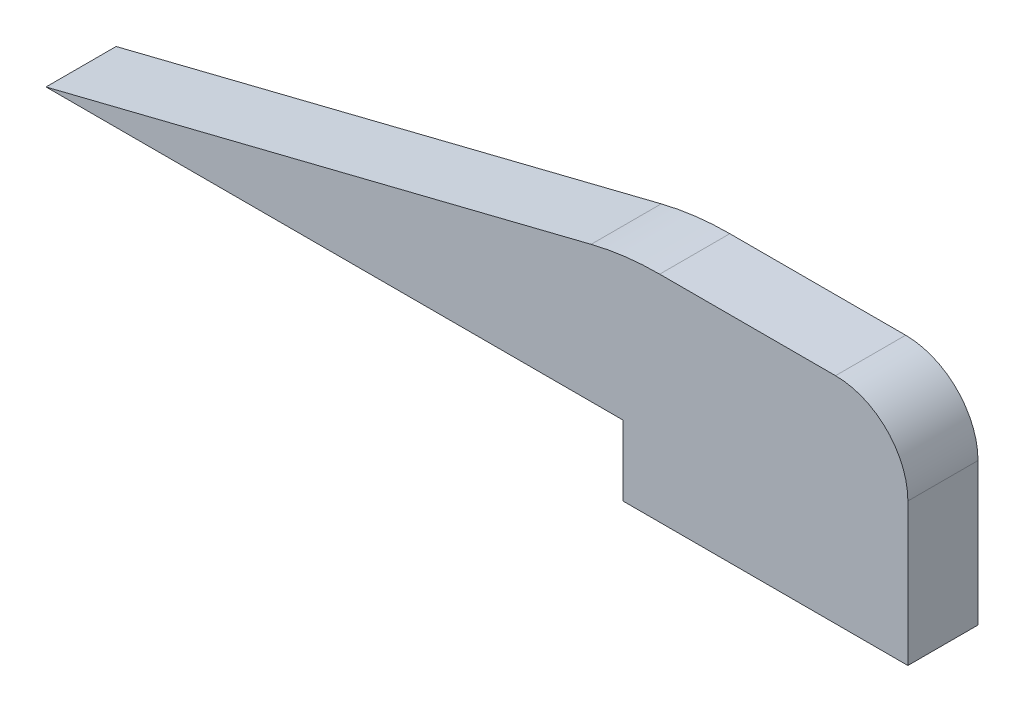
ISO-10303-21;
HEADER;
FILE_DESCRIPTION(('STEP AP214'),'2;1');
FILE_NAME('part.step','',(''),(''),'','','');
FILE_SCHEMA(('AUTOMOTIVE_DESIGN { 1 0 10303 214 1 1 1 1 }'));
ENDSEC;
DATA;
#1=APPLICATION_CONTEXT('core data for automotive mechanical design processes');
#2=APPLICATION_PROTOCOL_DEFINITION('international standard','automotive_design',2000,#1);
#3=PRODUCT_CONTEXT('',#1,'mechanical');
#4=PRODUCT('Part','Part','',(#3));
#5=PRODUCT_RELATED_PRODUCT_CATEGORY('part','',(#4));
#6=PRODUCT_DEFINITION_FORMATION('','',#4);
#7=PRODUCT_DEFINITION_CONTEXT('part definition',#1,'design');
#8=PRODUCT_DEFINITION('design','',#6,#7);
#9=PRODUCT_DEFINITION_SHAPE('','',#8);
#10=(LENGTH_UNIT() NAMED_UNIT(*) SI_UNIT(.MILLI.,.METRE.));
#11=(NAMED_UNIT(*) PLANE_ANGLE_UNIT() SI_UNIT($,.RADIAN.));
#12=(NAMED_UNIT(*) SI_UNIT($,.STERADIAN.) SOLID_ANGLE_UNIT());
#13=UNCERTAINTY_MEASURE_WITH_UNIT(LENGTH_MEASURE(1.E-05),#10,'distance_accuracy_value','');
#14=(GEOMETRIC_REPRESENTATION_CONTEXT(3) GLOBAL_UNCERTAINTY_ASSIGNED_CONTEXT((#13)) GLOBAL_UNIT_ASSIGNED_CONTEXT((#10,
#11,#12)) REPRESENTATION_CONTEXT('',''));
#15=CARTESIAN_POINT('',(0.,0.,0.));
#16=DIRECTION('',(0.,0.,1.));
#17=DIRECTION('',(1.,0.,0.));
#18=AXIS2_PLACEMENT_3D('',#15,#16,#17);
#19=CARTESIAN_POINT('',(34.925,3.175,3.175));
#20=DIRECTION('',(0.,0.,-1.));
#21=DIRECTION('',(-1.,0.,0.));
#22=AXIS2_PLACEMENT_3D('',#19,#20,#21);
#23=CYLINDRICAL_SURFACE('',#22,3.2766);
#24=CARTESIAN_POINT('',(34.925,3.175,0.));
#25=DIRECTION('',(0.,0.,1.));
#26=DIRECTION('',(-1.,0.,0.));
#27=AXIS2_PLACEMENT_3D('',#24,#25,#26);
#28=CIRCLE('',#27,3.2766);
#29=CARTESIAN_POINT('',(38.2016,3.175,0.));
#30=VERTEX_POINT('',#29);
#31=CARTESIAN_POINT('',(34.925,6.4516,0.));
#32=VERTEX_POINT('',#31);
#33=EDGE_CURVE('E191',#30,#32,#28,.T.);
#34=ORIENTED_EDGE('',*,*,#33,.T.);
#35=DIRECTION('',(0.,0.,-1.));
#36=VECTOR('',#35,1.);
#37=CARTESIAN_POINT('',(34.925,6.4516,3.175));
#38=LINE('',#37,#36);
#39=CARTESIAN_POINT('',(34.925,6.4516,3.175));
#40=VERTEX_POINT('',#39);
#41=EDGE_CURVE('E12',#40,#32,#38,.T.);
#42=ORIENTED_EDGE('',*,*,#41,.F.);
#43=CARTESIAN_POINT('',(34.925,3.175,3.175));
#44=DIRECTION('',(0.,0.,1.));
#45=DIRECTION('',(-1.,0.,0.));
#46=AXIS2_PLACEMENT_3D('',#43,#44,#45);
#47=CIRCLE('',#46,3.2766);
#48=CARTESIAN_POINT('',(38.2016,3.175,3.175));
#49=VERTEX_POINT('',#48);
#50=EDGE_CURVE('E156',#49,#40,#47,.T.);
#51=ORIENTED_EDGE('',*,*,#50,.F.);
#52=DIRECTION('',(0.,0.,-1.));
#53=VECTOR('',#52,1.);
#54=CARTESIAN_POINT('',(38.2016,3.175,3.175));
#55=LINE('',#54,#53);
#56=EDGE_CURVE('E131',#49,#30,#55,.T.);
#57=ORIENTED_EDGE('',*,*,#56,.T.);
#58=EDGE_LOOP('',(#34,#42,#51,#57));
#59=FACE_BOUND('',#58,.T.);
#60=ADVANCED_FACE('F36',(#59),#23,.T.);
#61=CARTESIAN_POINT('',(26.9634414453443,6.4516,3.175));
#62=DIRECTION('',(0.,-1.,0.));
#63=DIRECTION('',(0.,0.,-1.));
#64=AXIS2_PLACEMENT_3D('',#61,#62,#63);
#65=PLANE('',#64);
#66=DIRECTION('',(-1.,0.,0.));
#67=VECTOR('',#66,1.);
#68=CARTESIAN_POINT('',(26.9634414453443,6.4516,0.));
#69=LINE('',#68,#67);
#70=CARTESIAN_POINT('',(26.9634414453443,6.4516,0.));
#71=VERTEX_POINT('',#70);
#72=EDGE_CURVE('E185',#32,#71,#69,.T.);
#73=ORIENTED_EDGE('',*,*,#72,.T.);
#74=DIRECTION('',(0.,0.,-1.));
#75=VECTOR('',#74,1.);
#76=CARTESIAN_POINT('',(26.9634414453443,6.4516,3.175));
#77=LINE('',#76,#75);
#78=CARTESIAN_POINT('',(26.9634414453443,6.4516,3.175));
#79=VERTEX_POINT('',#78);
#80=EDGE_CURVE('E44',#79,#71,#77,.T.);
#81=ORIENTED_EDGE('',*,*,#80,.F.);
#82=DIRECTION('',(-1.,0.,0.));
#83=VECTOR('',#82,1.);
#84=CARTESIAN_POINT('',(26.9634414453443,6.4516,3.175));
#85=LINE('',#84,#83);
#86=EDGE_CURVE('E95',#40,#79,#85,.T.);
#87=ORIENTED_EDGE('',*,*,#86,.F.);
#88=ORIENTED_EDGE('',*,*,#41,.T.);
#89=EDGE_LOOP('',(#73,#81,#87,#88));
#90=FACE_BOUND('',#89,.T.);
#91=ADVANCED_FACE('F210',(#90),#65,.F.);
#92=CARTESIAN_POINT('',(26.9634414453443,-6.35,3.175));
#93=DIRECTION('',(0.,0.,-1.));
#94=DIRECTION('',(-1.,0.,0.));
#95=AXIS2_PLACEMENT_3D('',#92,#93,#94);
#96=CYLINDRICAL_SURFACE('',#95,12.8016);
#97=CARTESIAN_POINT('',(26.9634414453443,-6.35,0.));
#98=DIRECTION('',(0.,0.,1.));
#99=DIRECTION('',(-1.,0.,0.));
#100=AXIS2_PLACEMENT_3D('',#97,#98,#99);
#101=CIRCLE('',#100,12.8016);
#102=CARTESIAN_POINT('',(23.8585973878792,6.06937622986048,0.));
#103=VERTEX_POINT('',#102);
#104=EDGE_CURVE('E180',#71,#103,#101,.T.);
#105=ORIENTED_EDGE('',*,*,#104,.T.);
#106=DIRECTION('',(0.,0.,-1.));
#107=VECTOR('',#106,1.);
#108=CARTESIAN_POINT('',(23.8585973878792,6.06937622986048,3.175));
#109=LINE('',#108,#107);
#110=CARTESIAN_POINT('',(23.8585973878792,6.06937622986048,3.175));
#111=VERTEX_POINT('',#110);
#112=EDGE_CURVE('E172',#111,#103,#109,.T.);
#113=ORIENTED_EDGE('',*,*,#112,.F.);
#114=CARTESIAN_POINT('',(26.9634414453443,-6.35,3.175));
#115=DIRECTION('',(0.,0.,1.));
#116=DIRECTION('',(-1.,0.,0.));
#117=AXIS2_PLACEMENT_3D('',#114,#115,#116);
#118=CIRCLE('',#117,12.8016);
#119=EDGE_CURVE('E148',#79,#111,#118,.T.);
#120=ORIENTED_EDGE('',*,*,#119,.F.);
#121=ORIENTED_EDGE('',*,*,#80,.T.);
#122=EDGE_LOOP('',(#105,#113,#120,#121));
#123=FACE_BOUND('',#122,.T.);
#124=ADVANCED_FACE('F178',(#123),#96,.T.);
#125=CARTESIAN_POINT('',(-0.825307531562761,-0.101600000000002,3.175));
#126=DIRECTION('',(0.242535625036333,-0.970142500145332,0.));
#127=DIRECTION('',(0.970142500145332,0.242535625036333,0.));
#128=AXIS2_PLACEMENT_3D('',#125,#126,#127);
#129=PLANE('',#128);
#130=DIRECTION('',(-0.970142500145332,-0.242535625036333,0.));
#131=VECTOR('',#130,1.);
#132=CARTESIAN_POINT('',(-0.825307531562761,-0.101600000000002,0.));
#133=LINE('',#132,#131);
#134=CARTESIAN_POINT('',(-0.825307531562761,-0.101600000000002,0.));
#135=VERTEX_POINT('',#134);
#136=EDGE_CURVE('E187',#103,#135,#133,.T.);
#137=ORIENTED_EDGE('',*,*,#136,.T.);
#138=DIRECTION('',(0.,0.,-1.));
#139=VECTOR('',#138,1.);
#140=CARTESIAN_POINT('',(-0.825307531562761,-0.101600000000002,3.175));
#141=LINE('',#140,#139);
#142=CARTESIAN_POINT('',(-0.825307531562761,-0.101600000000002,3.175));
#143=VERTEX_POINT('',#142);
#144=EDGE_CURVE('E169',#143,#135,#141,.T.);
#145=ORIENTED_EDGE('',*,*,#144,.F.);
#146=DIRECTION('',(-0.970142500145332,-0.242535625036333,0.));
#147=VECTOR('',#146,1.);
#148=CARTESIAN_POINT('',(-0.825307531562761,-0.101600000000002,3.175));
#149=LINE('',#148,#147);
#150=EDGE_CURVE('E144',#111,#143,#149,.T.);
#151=ORIENTED_EDGE('',*,*,#150,.F.);
#152=ORIENTED_EDGE('',*,*,#112,.T.);
#153=EDGE_LOOP('',(#137,#145,#151,#152));
#154=FACE_BOUND('',#153,.T.);
#155=ADVANCED_FACE('F217',(#154),#129,.F.);
#156=CARTESIAN_POINT('',(25.2984,-0.101600000000002,3.175));
#157=DIRECTION('',(0.,1.,0.));
#158=DIRECTION('',(0.,0.,1.));
#159=AXIS2_PLACEMENT_3D('',#156,#157,#158);
#160=PLANE('',#159);
#161=DIRECTION('',(1.,0.,0.));
#162=VECTOR('',#161,1.);
#163=CARTESIAN_POINT('',(25.2984,-0.101600000000002,0.));
#164=LINE('',#163,#162);
#165=CARTESIAN_POINT('',(25.2984,-0.101600000000002,0.));
#166=VERTEX_POINT('',#165);
#167=EDGE_CURVE('E189',#135,#166,#164,.T.);
#168=ORIENTED_EDGE('',*,*,#167,.T.);
#169=DIRECTION('',(0.,0.,-1.));
#170=VECTOR('',#169,1.);
#171=CARTESIAN_POINT('',(25.2984,-0.101600000000002,3.175));
#172=LINE('',#171,#170);
#173=CARTESIAN_POINT('',(25.2984,-0.101600000000002,3.175));
#174=VERTEX_POINT('',#173);
#175=EDGE_CURVE('E124',#174,#166,#172,.T.);
#176=ORIENTED_EDGE('',*,*,#175,.F.);
#177=DIRECTION('',(1.,0.,0.));
#178=VECTOR('',#177,1.);
#179=CARTESIAN_POINT('',(25.2984,-0.101600000000002,3.175));
#180=LINE('',#179,#178);
#181=EDGE_CURVE('E114',#143,#174,#180,.T.);
#182=ORIENTED_EDGE('',*,*,#181,.F.);
#183=ORIENTED_EDGE('',*,*,#144,.T.);
#184=EDGE_LOOP('',(#168,#176,#182,#183));
#185=FACE_BOUND('',#184,.T.);
#186=ADVANCED_FACE('F195',(#185),#160,.F.);
#187=CARTESIAN_POINT('',(25.2984,-3.2766,3.175));
#188=DIRECTION('',(1.,0.,0.));
#189=DIRECTION('',(0.,0.,-1.));
#190=AXIS2_PLACEMENT_3D('',#187,#188,#189);
#191=PLANE('',#190);
#192=DIRECTION('',(0.,-1.,0.));
#193=VECTOR('',#192,1.);
#194=CARTESIAN_POINT('',(25.2984,-3.2766,0.));
#195=LINE('',#194,#193);
#196=CARTESIAN_POINT('',(25.2984,-3.2766,0.));
#197=VERTEX_POINT('',#196);
#198=EDGE_CURVE('E123',#166,#197,#195,.T.);
#199=ORIENTED_EDGE('',*,*,#198,.T.);
#200=DIRECTION('',(0.,0.,-1.));
#201=VECTOR('',#200,1.);
#202=CARTESIAN_POINT('',(25.2984,-3.2766,3.175));
#203=LINE('',#202,#201);
#204=CARTESIAN_POINT('',(25.2984,-3.2766,3.175));
#205=VERTEX_POINT('',#204);
#206=EDGE_CURVE('E120',#205,#197,#203,.T.);
#207=ORIENTED_EDGE('',*,*,#206,.F.);
#208=DIRECTION('',(0.,-1.,0.));
#209=VECTOR('',#208,1.);
#210=CARTESIAN_POINT('',(25.2984,-3.2766,3.175));
#211=LINE('',#210,#209);
#212=EDGE_CURVE('E108',#174,#205,#211,.T.);
#213=ORIENTED_EDGE('',*,*,#212,.F.);
#214=ORIENTED_EDGE('',*,*,#175,.T.);
#215=EDGE_LOOP('',(#199,#207,#213,#214));
#216=FACE_BOUND('',#215,.T.);
#217=ADVANCED_FACE('F121',(#216),#191,.F.);
#218=CARTESIAN_POINT('',(38.2016,-3.2766,3.175));
#219=DIRECTION('',(0.,1.,0.));
#220=DIRECTION('',(0.,0.,1.));
#221=AXIS2_PLACEMENT_3D('',#218,#219,#220);
#222=PLANE('',#221);
#223=DIRECTION('',(1.,0.,0.));
#224=VECTOR('',#223,1.);
#225=CARTESIAN_POINT('',(38.2016,-3.2766,0.));
#226=LINE('',#225,#224);
#227=CARTESIAN_POINT('',(38.2016,-3.2766,0.));
#228=VERTEX_POINT('',#227);
#229=EDGE_CURVE('E81',#197,#228,#226,.T.);
#230=ORIENTED_EDGE('',*,*,#229,.T.);
#231=DIRECTION('',(0.,0.,-1.));
#232=VECTOR('',#231,1.);
#233=CARTESIAN_POINT('',(38.2016,-3.2766,3.175));
#234=LINE('',#233,#232);
#235=CARTESIAN_POINT('',(38.2016,-3.2766,3.175));
#236=VERTEX_POINT('',#235);
#237=EDGE_CURVE('E125',#236,#228,#234,.T.);
#238=ORIENTED_EDGE('',*,*,#237,.F.);
#239=DIRECTION('',(1.,0.,0.));
#240=VECTOR('',#239,1.);
#241=CARTESIAN_POINT('',(38.2016,-3.2766,3.175));
#242=LINE('',#241,#240);
#243=EDGE_CURVE('E112',#205,#236,#242,.T.);
#244=ORIENTED_EDGE('',*,*,#243,.F.);
#245=ORIENTED_EDGE('',*,*,#206,.T.);
#246=EDGE_LOOP('',(#230,#238,#244,#245));
#247=FACE_BOUND('',#246,.T.);
#248=ADVANCED_FACE('F127',(#247),#222,.F.);
#249=CARTESIAN_POINT('',(38.2016,3.175,3.175));
#250=DIRECTION('',(-1.,0.,0.));
#251=DIRECTION('',(0.,0.,1.));
#252=AXIS2_PLACEMENT_3D('',#249,#250,#251);
#253=PLANE('',#252);
#254=DIRECTION('',(0.,1.,0.));
#255=VECTOR('',#254,1.);
#256=CARTESIAN_POINT('',(38.2016,3.175,0.));
#257=LINE('',#256,#255);
#258=EDGE_CURVE('E87',#228,#30,#257,.T.);
#259=ORIENTED_EDGE('',*,*,#258,.T.);
#260=ORIENTED_EDGE('',*,*,#56,.F.);
#261=DIRECTION('',(0.,1.,0.));
#262=VECTOR('',#261,1.);
#263=CARTESIAN_POINT('',(38.2016,3.175,3.175));
#264=LINE('',#263,#262);
#265=EDGE_CURVE('E52',#236,#49,#264,.T.);
#266=ORIENTED_EDGE('',*,*,#265,.F.);
#267=ORIENTED_EDGE('',*,*,#237,.T.);
#268=EDGE_LOOP('',(#259,#260,#266,#267));
#269=FACE_BOUND('',#268,.T.);
#270=ADVANCED_FACE('F199',(#269),#253,.F.);
#271=CARTESIAN_POINT('',(34.925,3.175,3.175));
#272=DIRECTION('',(0.,0.,-1.));
#273=DIRECTION('',(-1.,0.,0.));
#274=AXIS2_PLACEMENT_3D('',#271,#272,#273);
#275=PLANE('',#274);
#276=ORIENTED_EDGE('',*,*,#50,.T.);
#277=ORIENTED_EDGE('',*,*,#86,.T.);
#278=ORIENTED_EDGE('',*,*,#119,.T.);
#279=ORIENTED_EDGE('',*,*,#150,.T.);
#280=ORIENTED_EDGE('',*,*,#181,.T.);
#281=ORIENTED_EDGE('',*,*,#212,.T.);
#282=ORIENTED_EDGE('',*,*,#243,.T.);
#283=ORIENTED_EDGE('',*,*,#265,.T.);
#284=EDGE_LOOP('',(#276,#277,#278,#279,#280,#281,#282,#283));
#285=FACE_BOUND('',#284,.T.);
#286=ADVANCED_FACE('F110',(#285),#275,.F.);
#287=CARTESIAN_POINT('',(34.925,3.175,0.));
#288=DIRECTION('',(0.,0.,-1.));
#289=DIRECTION('',(-1.,0.,0.));
#290=AXIS2_PLACEMENT_3D('',#287,#288,#289);
#291=PLANE('',#290);
#292=ORIENTED_EDGE('',*,*,#33,.F.);
#293=ORIENTED_EDGE('',*,*,#258,.F.);
#294=ORIENTED_EDGE('',*,*,#229,.F.);
#295=ORIENTED_EDGE('',*,*,#198,.F.);
#296=ORIENTED_EDGE('',*,*,#167,.F.);
#297=ORIENTED_EDGE('',*,*,#136,.F.);
#298=ORIENTED_EDGE('',*,*,#104,.F.);
#299=ORIENTED_EDGE('',*,*,#72,.F.);
#300=EDGE_LOOP('',(#292,#293,#294,#295,#296,#297,#298,#299));
#301=FACE_BOUND('',#300,.T.);
#302=ADVANCED_FACE('F184',(#301),#291,.T.);
#303=CLOSED_SHELL('',(#60,#91,#124,#155,#186,#217,#248,#270,#286,#302));
#304=MANIFOLD_SOLID_BREP('B2',#303);
#305=ADVANCED_BREP_SHAPE_REPRESENTATION('',(#18,#304),#14);
#306=SHAPE_DEFINITION_REPRESENTATION(#9,#305);
ENDSEC;
END-ISO-10303-21;
